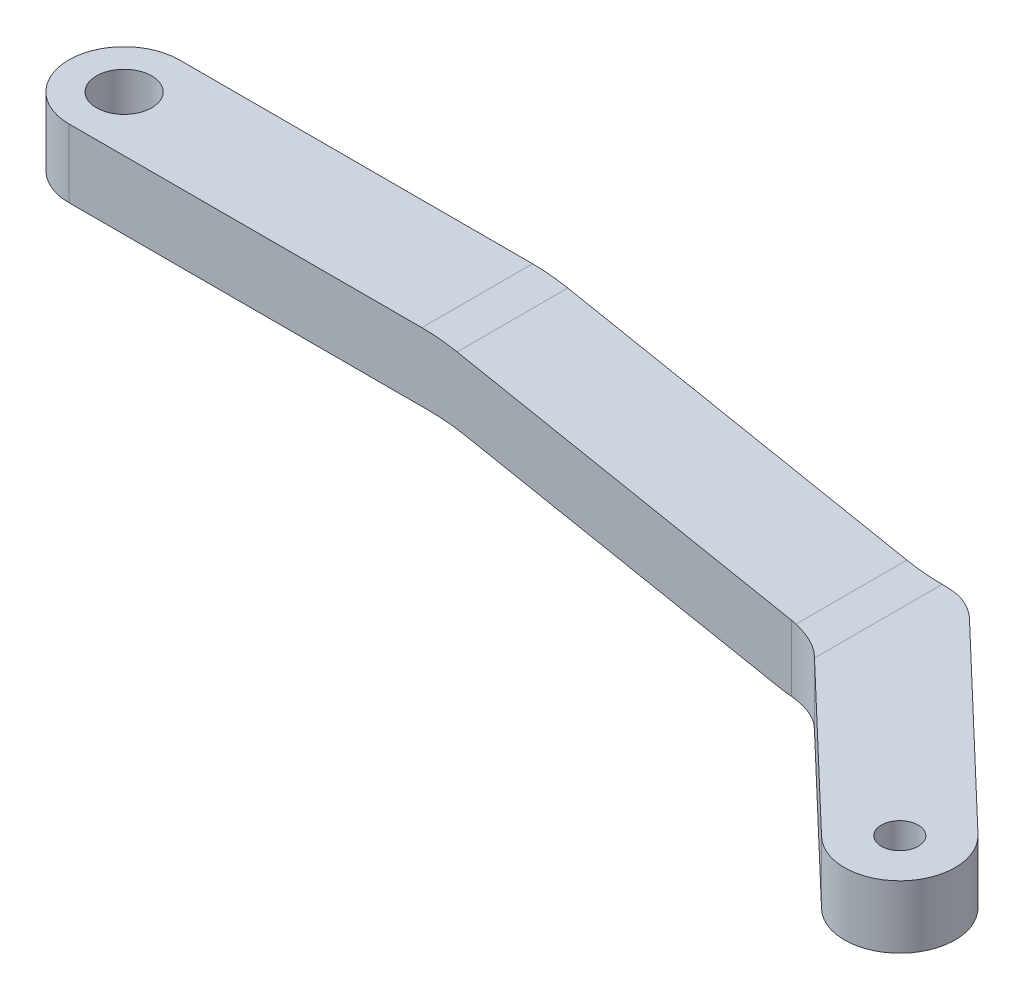
ISO-10303-21;
HEADER;
FILE_DESCRIPTION(('STEP AP214'),'2;1');
FILE_NAME('part.step','',(''),(''),'','','');
FILE_SCHEMA(('AUTOMOTIVE_DESIGN { 1 0 10303 214 1 1 1 1 }'));
ENDSEC;
DATA;
#1=APPLICATION_CONTEXT('core data for automotive mechanical design processes');
#2=APPLICATION_PROTOCOL_DEFINITION('international standard','automotive_design',2000,#1);
#3=PRODUCT_CONTEXT('',#1,'mechanical');
#4=PRODUCT('Part','Part','',(#3));
#5=PRODUCT_RELATED_PRODUCT_CATEGORY('part','',(#4));
#6=PRODUCT_DEFINITION_FORMATION('','',#4);
#7=PRODUCT_DEFINITION_CONTEXT('part definition',#1,'design');
#8=PRODUCT_DEFINITION('design','',#6,#7);
#9=PRODUCT_DEFINITION_SHAPE('','',#8);
#10=(LENGTH_UNIT() NAMED_UNIT(*) SI_UNIT(.MILLI.,.METRE.));
#11=(NAMED_UNIT(*) PLANE_ANGLE_UNIT() SI_UNIT($,.RADIAN.));
#12=(NAMED_UNIT(*) SI_UNIT($,.STERADIAN.) SOLID_ANGLE_UNIT());
#13=UNCERTAINTY_MEASURE_WITH_UNIT(LENGTH_MEASURE(1.E-05),#10,'distance_accuracy_value','');
#14=(GEOMETRIC_REPRESENTATION_CONTEXT(3) GLOBAL_UNCERTAINTY_ASSIGNED_CONTEXT((#13)) GLOBAL_UNIT_ASSIGNED_CONTEXT((#10,
#11,#12)) REPRESENTATION_CONTEXT('',''));
#15=CARTESIAN_POINT('',(0.,0.,0.));
#16=DIRECTION('',(0.,0.,1.));
#17=DIRECTION('',(1.,0.,0.));
#18=AXIS2_PLACEMENT_3D('',#15,#16,#17);
#19=CARTESIAN_POINT('',(-14.7120367770915,3.95,3.));
#20=DIRECTION('',(0.,-1.,0.));
#21=DIRECTION('',(0.,0.,-1.));
#22=AXIS2_PLACEMENT_3D('',#19,#20,#21);
#23=PLANE('',#22);
#24=CARTESIAN_POINT('',(-11.7120367770915,3.95,0.));
#25=DIRECTION('',(0.,1.,0.));
#26=DIRECTION('',(0.,0.,1.));
#27=AXIS2_PLACEMENT_3D('',#24,#25,#26);
#28=CIRCLE('',#27,1.5);
#29=CARTESIAN_POINT('',(-11.7120367770915,3.95,1.5));
#30=VERTEX_POINT('',#29);
#31=EDGE_CURVE('E204',#30,#30,#28,.T.);
#32=ORIENTED_EDGE('',*,*,#31,.F.);
#33=EDGE_LOOP('',(#32));
#34=FACE_BOUND('',#33,.T.);
#35=DIRECTION('',(-1.,0.,0.));
#36=VECTOR('',#35,1.);
#37=CARTESIAN_POINT('',(-14.7120367770915,3.95,3.));
#38=LINE('',#37,#36);
#39=CARTESIAN_POINT('',(7.43316248288966,3.95,3.));
#40=VERTEX_POINT('',#39);
#41=CARTESIAN_POINT('',(-11.7120367770915,3.94999999999999,3.));
#42=VERTEX_POINT('',#41);
#43=EDGE_CURVE('E178',#40,#42,#38,.T.);
#44=ORIENTED_EDGE('',*,*,#43,.F.);
#45=DIRECTION('',(0.,0.,-1.));
#46=VECTOR('',#45,1.);
#47=CARTESIAN_POINT('',(7.43316248288966,3.95,3.));
#48=LINE('',#47,#46);
#49=CARTESIAN_POINT('',(7.43316248288966,3.95,-3.));
#50=VERTEX_POINT('',#49);
#51=EDGE_CURVE('E227',#40,#50,#48,.T.);
#52=ORIENTED_EDGE('',*,*,#51,.T.);
#53=DIRECTION('',(-1.,0.,0.));
#54=VECTOR('',#53,1.);
#55=CARTESIAN_POINT('',(-14.7120367770915,3.95,-3.));
#56=LINE('',#55,#54);
#57=CARTESIAN_POINT('',(-11.7120367770915,3.94999999999999,-3.));
#58=VERTEX_POINT('',#57);
#59=EDGE_CURVE('E186',#50,#58,#56,.T.);
#60=ORIENTED_EDGE('',*,*,#59,.T.);
#61=CARTESIAN_POINT('',(-11.7120367770915,3.94999999999999,0.));
#62=DIRECTION('',(0.,1.,0.));
#63=DIRECTION('',(0.,0.,1.));
#64=AXIS2_PLACEMENT_3D('',#61,#62,#63);
#65=CIRCLE('',#64,3.);
#66=EDGE_CURVE('E196',#58,#42,#65,.T.);
#67=ORIENTED_EDGE('',*,*,#66,.T.);
#68=EDGE_LOOP('',(#44,#52,#60,#67));
#69=FACE_BOUND('',#68,.T.);
#70=ADVANCED_FACE('F37',(#34,#69),#23,.F.);
#71=CARTESIAN_POINT('',(0.,0.,3.));
#72=DIRECTION('',(0.,0.,-1.));
#73=DIRECTION('',(-1.,0.,0.));
#74=AXIS2_PLACEMENT_3D('',#71,#72,#73);
#75=PLANE('',#74);
#76=CARTESIAN_POINT('',(28.5301331179421,6.6,3.));
#77=DIRECTION('',(0.,0.,-1.));
#78=DIRECTION('',(-1.,0.,0.));
#79=AXIS2_PLACEMENT_3D('',#76,#77,#78);
#80=CIRCLE('',#79,10.);
#81=CARTESIAN_POINT('',(26.6183274982807,-3.21554885233785,3.));
#82=VERTEX_POINT('',#81);
#83=CARTESIAN_POINT('',(27.475314839453,-3.34421230663169,3.));
#84=VERTEX_POINT('',#83);
#85=EDGE_CURVE('E213',#82,#84,#80,.F.);
#86=ORIENTED_EDGE('',*,*,#85,.T.);
#87=DIRECTION('',(0.,1.,0.));
#88=VECTOR('',#87,1.);
#89=CARTESIAN_POINT('',(27.475314839453,0.0466508384333688,3.));
#90=LINE('',#89,#88);
#91=CARTESIAN_POINT('',(27.475314839453,0.234243644706561,3.));
#92=VERTEX_POINT('',#91);
#93=EDGE_CURVE('E248',#84,#92,#90,.T.);
#94=ORIENTED_EDGE('',*,*,#93,.T.);
#95=DIRECTION('',(-0.981554885233785,0.191180561966146,0.));
#96=VECTOR('',#95,1.);
#97=CARTESIAN_POINT('',(8.39796322290848,3.95,3.));
#98=LINE('',#97,#96);
#99=CARTESIAN_POINT('',(9.34496810255113,3.76554885233784,3.));
#100=VERTEX_POINT('',#99);
#101=EDGE_CURVE('E192',#92,#100,#98,.T.);
#102=ORIENTED_EDGE('',*,*,#101,.T.);
#103=CARTESIAN_POINT('',(7.43316248288966,-6.05000000000001,3.));
#104=DIRECTION('',(0.,0.,-1.));
#105=DIRECTION('',(-1.,0.,0.));
#106=AXIS2_PLACEMENT_3D('',#103,#104,#105);
#107=CIRCLE('',#106,10.);
#108=EDGE_CURVE('E211',#100,#40,#107,.F.);
#109=ORIENTED_EDGE('',*,*,#108,.T.);
#110=ORIENTED_EDGE('',*,*,#43,.T.);
#111=DIRECTION('',(0.,1.,0.));
#112=VECTOR('',#111,1.);
#113=CARTESIAN_POINT('',(-11.7120367770915,-3.4,3.));
#114=LINE('',#113,#112);
#115=CARTESIAN_POINT('',(-11.7120367770915,0.249999999999995,3.));
#116=VERTEX_POINT('',#115);
#117=EDGE_CURVE('E173',#116,#42,#114,.T.);
#118=ORIENTED_EDGE('',*,*,#117,.F.);
#119=DIRECTION('',(-1.,0.,0.));
#120=VECTOR('',#119,1.);
#121=CARTESIAN_POINT('',(-14.7120367770915,0.249999999999995,3.));
#122=LINE('',#121,#120);
#123=CARTESIAN_POINT('',(7.86078480246146,0.249999999999995,3.));
#124=VERTEX_POINT('',#123);
#125=EDGE_CURVE('E156',#124,#116,#122,.T.);
#126=ORIENTED_EDGE('',*,*,#125,.F.);
#127=CARTESIAN_POINT('',(7.86078480246146,-9.75000000000001,3.));
#128=DIRECTION('',(0.,0.,-1.));
#129=DIRECTION('',(-1.,0.,0.));
#130=AXIS2_PLACEMENT_3D('',#127,#128,#129);
#131=CIRCLE('',#130,10.);
#132=CARTESIAN_POINT('',(9.77259042212292,0.0655488523378425,3.));
#133=VERTEX_POINT('',#132);
#134=EDGE_CURVE('E230',#124,#133,#131,.T.);
#135=ORIENTED_EDGE('',*,*,#134,.T.);
#136=DIRECTION('',(-0.981554885233785,0.191180561966146,0.));
#137=VECTOR('',#136,1.);
#138=CARTESIAN_POINT('',(8.82558554248027,0.249999999999995,3.));
#139=LINE('',#138,#137);
#140=EDGE_CURVE('E167',#82,#133,#139,.T.);
#141=ORIENTED_EDGE('',*,*,#140,.F.);
#142=EDGE_LOOP('',(#86,#94,#102,#109,#110,#118,#126,#135,#141));
#143=FACE_BOUND('',#142,.T.);
#144=ADVANCED_FACE('F181',(#143),#75,.F.);
#145=CARTESIAN_POINT('',(0.,0.,-3.));
#146=DIRECTION('',(0.,0.,-1.));
#147=DIRECTION('',(-1.,0.,0.));
#148=AXIS2_PLACEMENT_3D('',#145,#146,#147);
#149=PLANE('',#148);
#150=DIRECTION('',(1.,0.,0.));
#151=VECTOR('',#150,1.);
#152=CARTESIAN_POINT('',(-11.7120367770915,0.,-3.));
#153=LINE('',#152,#151);
#154=CARTESIAN_POINT('',(29.6427639629273,0.,-3.));
#155=VERTEX_POINT('',#154);
#156=CARTESIAN_POINT('',(29.8806116063639,0.,-3.));
#157=VERTEX_POINT('',#156);
#158=EDGE_CURVE('E339',#155,#157,#153,.T.);
#159=ORIENTED_EDGE('',*,*,#158,.T.);
#160=DIRECTION('',(0.,1.,0.));
#161=VECTOR('',#160,1.);
#162=CARTESIAN_POINT('',(29.8806116063639,-3.4,-3.));
#163=LINE('',#162,#161);
#164=CARTESIAN_POINT('',(29.8806116063639,-3.4,-3.));
#165=VERTEX_POINT('',#164);
#166=EDGE_CURVE('E244',#157,#165,#163,.F.);
#167=ORIENTED_EDGE('',*,*,#166,.T.);
#168=DIRECTION('',(1.,0.,0.));
#169=VECTOR('',#168,1.);
#170=CARTESIAN_POINT('',(-11.7120367770915,-3.4,-3.));
#171=LINE('',#170,#169);
#172=CARTESIAN_POINT('',(28.5301331179421,-3.4,-3.));
#173=VERTEX_POINT('',#172);
#174=EDGE_CURVE('E314',#173,#165,#171,.T.);
#175=ORIENTED_EDGE('',*,*,#174,.F.);
#176=CARTESIAN_POINT('',(28.5301331179421,6.6,-3.));
#177=DIRECTION('',(0.,0.,-1.));
#178=DIRECTION('',(-1.,0.,0.));
#179=AXIS2_PLACEMENT_3D('',#176,#177,#178);
#180=CIRCLE('',#179,10.);
#181=CARTESIAN_POINT('',(26.6183274982807,-3.21554885233785,-3.));
#182=VERTEX_POINT('',#181);
#183=EDGE_CURVE('E218',#173,#182,#180,.T.);
#184=ORIENTED_EDGE('',*,*,#183,.T.);
#185=DIRECTION('',(-0.981554885233785,0.191180561966146,0.));
#186=VECTOR('',#185,1.);
#187=CARTESIAN_POINT('',(8.82558554248027,0.249999999999995,-3.));
#188=LINE('',#187,#186);
#189=CARTESIAN_POINT('',(9.77259042212292,0.0655488523378425,-3.));
#190=VERTEX_POINT('',#189);
#191=EDGE_CURVE('E166',#182,#190,#188,.T.);
#192=ORIENTED_EDGE('',*,*,#191,.T.);
#193=CARTESIAN_POINT('',(7.86078480246146,-9.75000000000001,-3.));
#194=DIRECTION('',(0.,0.,-1.));
#195=DIRECTION('',(-1.,0.,0.));
#196=AXIS2_PLACEMENT_3D('',#193,#194,#195);
#197=CIRCLE('',#196,10.);
#198=CARTESIAN_POINT('',(7.86078480246146,0.249999999999995,-3.));
#199=VERTEX_POINT('',#198);
#200=EDGE_CURVE('E232',#190,#199,#197,.F.);
#201=ORIENTED_EDGE('',*,*,#200,.T.);
#202=DIRECTION('',(-1.,0.,0.));
#203=VECTOR('',#202,1.);
#204=CARTESIAN_POINT('',(-14.7120367770915,0.249999999999995,-3.));
#205=LINE('',#204,#203);
#206=CARTESIAN_POINT('',(-11.7120367770915,0.249999999999995,-3.));
#207=VERTEX_POINT('',#206);
#208=EDGE_CURVE('E198',#199,#207,#205,.T.);
#209=ORIENTED_EDGE('',*,*,#208,.T.);
#210=DIRECTION('',(0.,1.,0.));
#211=VECTOR('',#210,1.);
#212=CARTESIAN_POINT('',(-11.7120367770915,-3.4,-3.));
#213=LINE('',#212,#211);
#214=EDGE_CURVE('E176',#207,#58,#213,.T.);
#215=ORIENTED_EDGE('',*,*,#214,.T.);
#216=ORIENTED_EDGE('',*,*,#59,.F.);
#217=CARTESIAN_POINT('',(7.43316248288966,-6.05000000000001,-3.));
#218=DIRECTION('',(0.,0.,-1.));
#219=DIRECTION('',(-1.,0.,0.));
#220=AXIS2_PLACEMENT_3D('',#217,#218,#219);
#221=CIRCLE('',#220,10.);
#222=CARTESIAN_POINT('',(9.34496810255113,3.76554885233784,-3.));
#223=VERTEX_POINT('',#222);
#224=EDGE_CURVE('E216',#50,#223,#221,.T.);
#225=ORIENTED_EDGE('',*,*,#224,.T.);
#226=DIRECTION('',(-0.981554885233785,0.191180561966146,0.));
#227=VECTOR('',#226,1.);
#228=CARTESIAN_POINT('',(8.39796322290848,3.95,-3.));
#229=LINE('',#228,#227);
#230=CARTESIAN_POINT('',(27.7309583432658,0.184451147662151,-3.));
#231=VERTEX_POINT('',#230);
#232=EDGE_CURVE('E183',#231,#223,#229,.T.);
#233=ORIENTED_EDGE('',*,*,#232,.F.);
#234=CARTESIAN_POINT('',(29.6427639629273,10.,-3.));
#235=DIRECTION('',(0.,0.,-1.));
#236=DIRECTION('',(-1.,0.,0.));
#237=AXIS2_PLACEMENT_3D('',#234,#235,#236);
#238=CIRCLE('',#237,10.);
#239=EDGE_CURVE('E234',#231,#155,#238,.F.);
#240=ORIENTED_EDGE('',*,*,#239,.T.);
#241=EDGE_LOOP('',(#159,#167,#175,#184,#192,#201,#209,#215,#216,#225,#233,#240));
#242=FACE_BOUND('',#241,.T.);
#243=ADVANCED_FACE('F284',(#242),#149,.T.);
#244=CARTESIAN_POINT('',(8.39796322290848,3.95,3.));
#245=DIRECTION('',(-0.191180561966146,-0.981554885233785,0.));
#246=DIRECTION('',(0.981554885233785,-0.191180561966146,0.));
#247=AXIS2_PLACEMENT_3D('',#244,#245,#246);
#248=PLANE('',#247);
#249=ORIENTED_EDGE('',*,*,#101,.F.);
#250=CARTESIAN_POINT('',(27.475314839453,0.234243644706562,6.));
#251=DIRECTION('',(-0.191180561966146,-0.981554885233785,0.));
#252=DIRECTION('',(0.981554885233785,-0.191180561966146,0.));
#253=AXIS2_PLACEMENT_3D('',#250,#251,#252);
#254=ELLIPSE('',#253,3.05637519116974,3.);
#255=CARTESIAN_POINT('',(27.7309583432658,0.184451147662154,3.0109121125403));
#256=VERTEX_POINT('',#255);
#257=EDGE_CURVE('E253',#92,#256,#254,.T.);
#258=ORIENTED_EDGE('',*,*,#257,.T.);
#259=DIRECTION('',(0.,0.,-1.));
#260=VECTOR('',#259,1.);
#261=CARTESIAN_POINT('',(27.7309583432658,0.184451147662154,-3.));
#262=LINE('',#261,#260);
#263=EDGE_CURVE('E65',#256,#231,#262,.T.);
#264=ORIENTED_EDGE('',*,*,#263,.T.);
#265=ORIENTED_EDGE('',*,*,#232,.T.);
#266=DIRECTION('',(0.,0.,-1.));
#267=VECTOR('',#266,1.);
#268=CARTESIAN_POINT('',(9.34496810255113,3.76554885233784,3.));
#269=LINE('',#268,#267);
#270=EDGE_CURVE('E221',#223,#100,#269,.F.);
#271=ORIENTED_EDGE('',*,*,#270,.T.);
#272=EDGE_LOOP('',(#249,#258,#264,#265,#271));
#273=FACE_BOUND('',#272,.T.);
#274=ADVANCED_FACE('F290',(#273),#248,.F.);
#275=CARTESIAN_POINT('',(28.6779632229085,-3.4,3.));
#276=DIRECTION('',(0.690756218983956,0.,-0.723087716625714));
#277=DIRECTION('',(-0.723087716625714,0.,-0.690756218983956));
#278=AXIS2_PLACEMENT_3D('',#275,#276,#277);
#279=PLANE('',#278);
#280=CARTESIAN_POINT('',(29.6427639629273,10.,3.92166150236692));
#281=DIRECTION('',(0.690756218983956,0.,-0.723087716625714));
#282=DIRECTION('',(0.723087716625714,0.,0.690756218983956));
#283=AXIS2_PLACEMENT_3D('',#280,#281,#282);
#284=ELLIPSE('',#283,13.8295807964557,10.);
#285=CARTESIAN_POINT('',(29.6427639629273,0.,3.92166150236692));
#286=VERTEX_POINT('',#285);
#287=CARTESIAN_POINT('',(29.5475834964049,0.000452976319747014,3.83073685012286));
#288=VERTEX_POINT('',#287);
#289=EDGE_CURVE('E236',#286,#288,#284,.T.);
#290=ORIENTED_EDGE('',*,*,#289,.T.);
#291=DIRECTION('',(0.,1.,0.));
#292=VECTOR('',#291,1.);
#293=CARTESIAN_POINT('',(29.5475834964049,-3.4,3.83073685012286));
#294=LINE('',#293,#292);
#295=CARTESIAN_POINT('',(29.5475834964049,-3.4,3.83073685012286));
#296=VERTEX_POINT('',#295);
#297=EDGE_CURVE('E251',#288,#296,#294,.F.);
#298=ORIENTED_EDGE('',*,*,#297,.T.);
#299=DIRECTION('',(-0.723087716625714,0.,-0.690756218983956));
#300=VECTOR('',#299,1.);
#301=CARTESIAN_POINT('',(28.6779632229085,-3.4,3.));
#302=LINE('',#301,#300);
#303=CARTESIAN_POINT('',(38.2227210823679,-3.4,12.1179820905882));
#304=VERTEX_POINT('',#303);
#305=EDGE_CURVE('E327',#304,#296,#302,.T.);
#306=ORIENTED_EDGE('',*,*,#305,.F.);
#307=DIRECTION('',(0.,1.,0.));
#308=VECTOR('',#307,1.);
#309=CARTESIAN_POINT('',(38.2227210823679,-3.4,12.1179820905882));
#310=LINE('',#309,#308);
#311=CARTESIAN_POINT('',(38.2227210823679,0.,12.1179820905882));
#312=VERTEX_POINT('',#311);
#313=EDGE_CURVE('E336',#304,#312,#310,.T.);
#314=ORIENTED_EDGE('',*,*,#313,.T.);
#315=DIRECTION('',(-0.723087716625714,0.,-0.690756218983956));
#316=VECTOR('',#315,1.);
#317=CARTESIAN_POINT('',(28.6779632229085,0.,3.));
#318=LINE('',#317,#316);
#319=EDGE_CURVE('E197',#312,#286,#318,.T.);
#320=ORIENTED_EDGE('',*,*,#319,.T.);
#321=EDGE_LOOP('',(#290,#298,#306,#314,#320));
#322=FACE_BOUND('',#321,.T.);
#323=ADVANCED_FACE('F292',(#322),#279,.F.);
#324=CARTESIAN_POINT('',(-11.7120367770915,-3.4,0.));
#325=DIRECTION('',(0.,1.,0.));
#326=DIRECTION('',(-1.,0.,0.));
#327=AXIS2_PLACEMENT_3D('',#324,#325,#326);
#328=CYLINDRICAL_SURFACE('',#327,3.);
#329=ORIENTED_EDGE('',*,*,#214,.F.);
#330=CARTESIAN_POINT('',(-11.7120367770915,0.249999999999995,0.));
#331=DIRECTION('',(0.,1.,0.));
#332=DIRECTION('',(0.,0.,1.));
#333=AXIS2_PLACEMENT_3D('',#330,#331,#332);
#334=CIRCLE('',#333,3.);
#335=EDGE_CURVE('E160',#207,#116,#334,.T.);
#336=ORIENTED_EDGE('',*,*,#335,.T.);
#337=ORIENTED_EDGE('',*,*,#117,.T.);
#338=ORIENTED_EDGE('',*,*,#66,.F.);
#339=EDGE_LOOP('',(#329,#336,#337,#338));
#340=FACE_BOUND('',#339,.T.);
#341=ADVANCED_FACE('F171',(#340),#328,.T.);
#342=CARTESIAN_POINT('',(42.3672583962716,-3.4,7.77945579083393));
#343=DIRECTION('',(-0.690756218983955,0.,0.723087716625715));
#344=DIRECTION('',(0.723087716625715,0.,0.690756218983955));
#345=AXIS2_PLACEMENT_3D('',#342,#343,#344);
#346=PLANE('',#345);
#347=DIRECTION('',(0.723087716625715,0.,0.690756218983955));
#348=VECTOR('',#347,1.);
#349=CARTESIAN_POINT('',(42.3672583962716,-3.4,7.77945579083393));
#350=LINE('',#349,#348);
#351=CARTESIAN_POINT('',(31.9528802633158,-3.4,-2.16926314987714));
#352=VERTEX_POINT('',#351);
#353=CARTESIAN_POINT('',(42.3672583962716,-3.4,7.77945579083393));
#354=VERTEX_POINT('',#353);
#355=EDGE_CURVE('E332',#352,#354,#350,.T.);
#356=ORIENTED_EDGE('',*,*,#355,.F.);
#357=DIRECTION('',(0.,1.,0.));
#358=VECTOR('',#357,1.);
#359=CARTESIAN_POINT('',(31.9528802633158,0.,-2.16926314987715));
#360=LINE('',#359,#358);
#361=CARTESIAN_POINT('',(31.9528802633158,0.,-2.16926314987714));
#362=VERTEX_POINT('',#361);
#363=EDGE_CURVE('E239',#352,#362,#360,.T.);
#364=ORIENTED_EDGE('',*,*,#363,.T.);
#365=DIRECTION('',(0.723087716625715,0.,0.690756218983955));
#366=VECTOR('',#365,1.);
#367=CARTESIAN_POINT('',(42.3672583962716,0.,7.77945579083393));
#368=LINE('',#367,#366);
#369=CARTESIAN_POINT('',(42.3672583962716,0.,7.77945579083393));
#370=VERTEX_POINT('',#369);
#371=EDGE_CURVE('E341',#362,#370,#368,.T.);
#372=ORIENTED_EDGE('',*,*,#371,.T.);
#373=DIRECTION('',(0.,1.,0.));
#374=VECTOR('',#373,1.);
#375=CARTESIAN_POINT('',(42.3672583962716,-3.4,7.77945579083393));
#376=LINE('',#375,#374);
#377=EDGE_CURVE('E188',#354,#370,#376,.T.);
#378=ORIENTED_EDGE('',*,*,#377,.F.);
#379=EDGE_LOOP('',(#356,#364,#372,#378));
#380=FACE_BOUND('',#379,.T.);
#381=ADVANCED_FACE('F371',(#380),#346,.F.);
#382=CARTESIAN_POINT('',(40.2949897393198,-3.4,9.94871894071107));
#383=DIRECTION('',(0.,1.,0.));
#384=DIRECTION('',(-1.,0.,0.));
#385=AXIS2_PLACEMENT_3D('',#382,#383,#384);
#386=CYLINDRICAL_SURFACE('',#385,3.);
#387=CARTESIAN_POINT('',(40.2949897393198,0.,9.94871894071107));
#388=DIRECTION('',(0.,-1.,0.));
#389=DIRECTION('',(1.,0.,0.));
#390=AXIS2_PLACEMENT_3D('',#387,#388,#389);
#391=CIRCLE('',#390,3.);
#392=EDGE_CURVE('E330',#370,#312,#391,.T.);
#393=ORIENTED_EDGE('',*,*,#392,.T.);
#394=ORIENTED_EDGE('',*,*,#313,.F.);
#395=CARTESIAN_POINT('',(40.2949897393198,-3.4,9.94871894071107));
#396=DIRECTION('',(0.,-1.,0.));
#397=DIRECTION('',(1.,0.,0.));
#398=AXIS2_PLACEMENT_3D('',#395,#396,#397);
#399=CIRCLE('',#398,3.);
#400=EDGE_CURVE('E334',#354,#304,#399,.T.);
#401=ORIENTED_EDGE('',*,*,#400,.F.);
#402=ORIENTED_EDGE('',*,*,#377,.T.);
#403=EDGE_LOOP('',(#393,#394,#401,#402));
#404=FACE_BOUND('',#403,.T.);
#405=ADVANCED_FACE('F350',(#404),#386,.T.);
#406=CARTESIAN_POINT('',(40.2949897393198,-3.4,9.94871894071107));
#407=DIRECTION('',(0.,-1.,0.));
#408=DIRECTION('',(1.,0.,0.));
#409=AXIS2_PLACEMENT_3D('',#406,#407,#408);
#410=PLANE('',#409);
#411=CARTESIAN_POINT('',(40.2949897393198,-3.4,9.94871894071107));
#412=DIRECTION('',(0.,1.,0.));
#413=DIRECTION('',(0.,0.,1.));
#414=AXIS2_PLACEMENT_3D('',#411,#412,#413);
#415=CIRCLE('',#414,0.999999999999998);
#416=CARTESIAN_POINT('',(40.2949897393198,-3.4,10.9487189407111));
#417=VERTEX_POINT('',#416);
#418=EDGE_CURVE('E323',#417,#417,#415,.T.);
#419=ORIENTED_EDGE('',*,*,#418,.T.);
#420=EDGE_LOOP('',(#419));
#421=FACE_BOUND('',#420,.T.);
#422=ORIENTED_EDGE('',*,*,#174,.T.);
#423=CARTESIAN_POINT('',(29.8806116063639,-3.4,0.));
#424=DIRECTION('',(0.,-1.,0.));
#425=DIRECTION('',(1.,0.,0.));
#426=AXIS2_PLACEMENT_3D('',#423,#424,#425);
#427=CIRCLE('',#426,3.);
#428=EDGE_CURVE('E246',#165,#352,#427,.T.);
#429=ORIENTED_EDGE('',*,*,#428,.T.);
#430=ORIENTED_EDGE('',*,*,#355,.T.);
#431=ORIENTED_EDGE('',*,*,#400,.T.);
#432=ORIENTED_EDGE('',*,*,#305,.T.);
#433=CARTESIAN_POINT('',(27.475314839453,-3.4,6.));
#434=DIRECTION('',(0.,-1.,0.));
#435=DIRECTION('',(1.,0.,0.));
#436=AXIS2_PLACEMENT_3D('',#433,#434,#435);
#437=CIRCLE('',#436,3.);
#438=CARTESIAN_POINT('',(28.5301331179421,-3.4,3.1915558756909));
#439=VERTEX_POINT('',#438);
#440=EDGE_CURVE('E51',#296,#439,#437,.F.);
#441=ORIENTED_EDGE('',*,*,#440,.T.);
#442=DIRECTION('',(0.,0.,1.));
#443=VECTOR('',#442,1.);
#444=CARTESIAN_POINT('',(28.5301331179421,-3.4,-3.));
#445=LINE('',#444,#443);
#446=EDGE_CURVE('E57',#439,#173,#445,.F.);
#447=ORIENTED_EDGE('',*,*,#446,.T.);
#448=EDGE_LOOP('',(#422,#429,#430,#431,#432,#441,#447));
#449=FACE_BOUND('',#448,.T.);
#450=ADVANCED_FACE('F369',(#421,#449),#410,.T.);
#451=CARTESIAN_POINT('',(40.2949897393198,0.,9.94871894071107));
#452=DIRECTION('',(0.,-1.,0.));
#453=DIRECTION('',(1.,0.,0.));
#454=AXIS2_PLACEMENT_3D('',#451,#452,#453);
#455=PLANE('',#454);
#456=CARTESIAN_POINT('',(40.2949897393198,0.,9.94871894071107));
#457=DIRECTION('',(0.,-1.,0.));
#458=DIRECTION('',(1.,0.,0.));
#459=AXIS2_PLACEMENT_3D('',#456,#457,#458);
#460=CIRCLE('',#459,0.999999999999998);
#461=CARTESIAN_POINT('',(41.2949897393198,0.,9.94871894071107));
#462=VERTEX_POINT('',#461);
#463=EDGE_CURVE('E203',#462,#462,#460,.T.);
#464=ORIENTED_EDGE('',*,*,#463,.T.);
#465=EDGE_LOOP('',(#464));
#466=FACE_BOUND('',#465,.T.);
#467=ORIENTED_EDGE('',*,*,#371,.F.);
#468=CARTESIAN_POINT('',(29.8806116063639,0.,0.));
#469=DIRECTION('',(0.,-1.,0.));
#470=DIRECTION('',(1.,0.,0.));
#471=AXIS2_PLACEMENT_3D('',#468,#469,#470);
#472=CIRCLE('',#471,3.);
#473=EDGE_CURVE('E242',#362,#157,#472,.F.);
#474=ORIENTED_EDGE('',*,*,#473,.T.);
#475=ORIENTED_EDGE('',*,*,#158,.F.);
#476=DIRECTION('',(0.,0.,-1.));
#477=VECTOR('',#476,1.);
#478=CARTESIAN_POINT('',(29.6427639629273,0.,3.));
#479=LINE('',#478,#477);
#480=EDGE_CURVE('E225',#155,#286,#479,.F.);
#481=ORIENTED_EDGE('',*,*,#480,.T.);
#482=ORIENTED_EDGE('',*,*,#319,.F.);
#483=ORIENTED_EDGE('',*,*,#392,.F.);
#484=EDGE_LOOP('',(#467,#474,#475,#481,#482,#483));
#485=FACE_BOUND('',#484,.T.);
#486=ADVANCED_FACE('F357',(#466,#485),#455,.F.);
#487=CARTESIAN_POINT('',(-14.7120367770915,0.249999999999995,-3.));
#488=DIRECTION('',(0.,1.,0.));
#489=DIRECTION('',(0.,0.,1.));
#490=AXIS2_PLACEMENT_3D('',#487,#488,#489);
#491=PLANE('',#490);
#492=CARTESIAN_POINT('',(-11.7120367770915,0.249999999999995,0.));
#493=DIRECTION('',(0.,1.,0.));
#494=DIRECTION('',(0.,0.,1.));
#495=AXIS2_PLACEMENT_3D('',#492,#493,#494);
#496=CIRCLE('',#495,1.5);
#497=CARTESIAN_POINT('',(-11.7120367770915,0.249999999999995,1.5));
#498=VERTEX_POINT('',#497);
#499=EDGE_CURVE('E200',#498,#498,#496,.T.);
#500=ORIENTED_EDGE('',*,*,#499,.T.);
#501=EDGE_LOOP('',(#500));
#502=FACE_BOUND('',#501,.T.);
#503=ORIENTED_EDGE('',*,*,#208,.F.);
#504=DIRECTION('',(0.,0.,1.));
#505=VECTOR('',#504,1.);
#506=CARTESIAN_POINT('',(7.86078480246146,0.249999999999995,3.));
#507=LINE('',#506,#505);
#508=EDGE_CURVE('E163',#199,#124,#507,.T.);
#509=ORIENTED_EDGE('',*,*,#508,.T.);
#510=ORIENTED_EDGE('',*,*,#125,.T.);
#511=ORIENTED_EDGE('',*,*,#335,.F.);
#512=EDGE_LOOP('',(#503,#509,#510,#511));
#513=FACE_BOUND('',#512,.T.);
#514=ADVANCED_FACE('F159',(#502,#513),#491,.F.);
#515=CARTESIAN_POINT('',(8.82558554248027,0.249999999999995,-3.));
#516=DIRECTION('',(0.191180561966146,0.981554885233785,0.));
#517=DIRECTION('',(-0.981554885233785,0.191180561966146,0.));
#518=AXIS2_PLACEMENT_3D('',#515,#516,#517);
#519=PLANE('',#518);
#520=ORIENTED_EDGE('',*,*,#191,.F.);
#521=DIRECTION('',(0.,0.,1.));
#522=VECTOR('',#521,1.);
#523=CARTESIAN_POINT('',(26.6183274982807,-3.21554885233785,3.));
#524=LINE('',#523,#522);
#525=EDGE_CURVE('E208',#182,#82,#524,.T.);
#526=ORIENTED_EDGE('',*,*,#525,.T.);
#527=ORIENTED_EDGE('',*,*,#140,.T.);
#528=DIRECTION('',(0.,0.,1.));
#529=VECTOR('',#528,1.);
#530=CARTESIAN_POINT('',(9.77259042212292,0.0655488523378413,-3.));
#531=LINE('',#530,#529);
#532=EDGE_CURVE('E177',#133,#190,#531,.F.);
#533=ORIENTED_EDGE('',*,*,#532,.T.);
#534=EDGE_LOOP('',(#520,#526,#527,#533));
#535=FACE_BOUND('',#534,.T.);
#536=ADVANCED_FACE('F316',(#535),#519,.F.);
#537=CARTESIAN_POINT('',(-11.7120367770915,-3.4,0.));
#538=DIRECTION('',(0.,1.,0.));
#539=DIRECTION('',(0.,0.,1.));
#540=AXIS2_PLACEMENT_3D('',#537,#538,#539);
#541=CYLINDRICAL_SURFACE('',#540,1.5);
#542=ORIENTED_EDGE('',*,*,#31,.T.);
#543=EDGE_LOOP('',(#542));
#544=FACE_BOUND('',#543,.T.);
#545=ORIENTED_EDGE('',*,*,#499,.F.);
#546=EDGE_LOOP('',(#545));
#547=FACE_BOUND('',#546,.T.);
#548=ADVANCED_FACE('F303',(#544,#547),#541,.F.);
#549=CARTESIAN_POINT('',(40.2949897393198,-3.4,9.94871894071107));
#550=DIRECTION('',(0.,1.,0.));
#551=DIRECTION('',(0.,0.,1.));
#552=AXIS2_PLACEMENT_3D('',#549,#550,#551);
#553=CYLINDRICAL_SURFACE('',#552,0.999999999999998);
#554=ORIENTED_EDGE('',*,*,#418,.F.);
#555=EDGE_LOOP('',(#554));
#556=FACE_BOUND('',#555,.T.);
#557=ORIENTED_EDGE('',*,*,#463,.F.);
#558=EDGE_LOOP('',(#557));
#559=FACE_BOUND('',#558,.T.);
#560=ADVANCED_FACE('F297',(#556,#559),#553,.F.);
#561=CARTESIAN_POINT('',(28.5301331179421,6.6,-3.));
#562=DIRECTION('',(0.,0.,-1.));
#563=DIRECTION('',(-1.,0.,0.));
#564=AXIS2_PLACEMENT_3D('',#561,#562,#563);
#565=CYLINDRICAL_SURFACE('',#564,10.);
#566=ORIENTED_EDGE('',*,*,#183,.F.);
#567=ORIENTED_EDGE('',*,*,#446,.F.);
#568=CARTESIAN_POINT('',(28.5301331179421,-3.4,3.1915558756909));
#569=CARTESIAN_POINT('',(28.4455326226416,-3.40001183912057,3.15976500866427));
#570=CARTESIAN_POINT('',(28.3594849522397,-3.39892642713121,3.13182489342494));
#571=CARTESIAN_POINT('',(28.1860353911706,-3.39444843201104,3.08403085094711));
#572=CARTESIAN_POINT('',(28.0986517296496,-3.39107594994117,3.06410886342384));
#573=CARTESIAN_POINT('',(27.9225749298865,-3.38191573279832,3.03217856692425));
#574=CARTESIAN_POINT('',(27.8338817913,-3.37612799709021,3.02017026002898));
#575=CARTESIAN_POINT('',(27.6551894687911,-3.3620601885166,3.0040384396043));
#576=CARTESIAN_POINT('',(27.5651856481966,-3.35375874445448,2.99998485896882));
#577=CARTESIAN_POINT('',(27.475314839453,-3.34421230663169,3.));
#578=B_SPLINE_CURVE_WITH_KNOTS('',3,(#568,#569,#570,#571,#572,#573,#574,#575,#576,#577),
.UNSPECIFIED.,.F.,.F.,(4,2,2,2,4),(0.,0.271030633270413,0.539709531884204,0.808388501152846,
1.07941912719599),.UNSPECIFIED.);
#579=EDGE_CURVE('E11',#439,#84,#578,.T.);
#580=ORIENTED_EDGE('',*,*,#579,.T.);
#581=ORIENTED_EDGE('',*,*,#85,.F.);
#582=ORIENTED_EDGE('',*,*,#525,.F.);
#583=EDGE_LOOP('',(#566,#567,#580,#581,#582));
#584=FACE_BOUND('',#583,.T.);
#585=ADVANCED_FACE('F294',(#584),#565,.T.);
#586=CARTESIAN_POINT('',(7.86078480246146,-9.75000000000001,-3.));
#587=DIRECTION('',(0.,0.,-1.));
#588=DIRECTION('',(-1.,0.,0.));
#589=AXIS2_PLACEMENT_3D('',#586,#587,#588);
#590=CYLINDRICAL_SURFACE('',#589,10.);
#591=ORIENTED_EDGE('',*,*,#200,.F.);
#592=ORIENTED_EDGE('',*,*,#532,.F.);
#593=ORIENTED_EDGE('',*,*,#134,.F.);
#594=ORIENTED_EDGE('',*,*,#508,.F.);
#595=EDGE_LOOP('',(#591,#592,#593,#594));
#596=FACE_BOUND('',#595,.T.);
#597=ADVANCED_FACE('F267',(#596),#590,.F.);
#598=CARTESIAN_POINT('',(29.6427639629273,10.,3.));
#599=DIRECTION('',(0.,0.,1.));
#600=DIRECTION('',(1.,0.,0.));
#601=AXIS2_PLACEMENT_3D('',#598,#599,#600);
#602=CYLINDRICAL_SURFACE('',#601,10.);
#603=ORIENTED_EDGE('',*,*,#289,.F.);
#604=ORIENTED_EDGE('',*,*,#480,.F.);
#605=ORIENTED_EDGE('',*,*,#239,.F.);
#606=ORIENTED_EDGE('',*,*,#263,.F.);
#607=CARTESIAN_POINT('',(27.7309583432658,0.184451147662152,3.0109121125403));
#608=CARTESIAN_POINT('',(27.8123487664852,0.168588291265019,3.01786123310681));
#609=CARTESIAN_POINT('',(27.8936675699991,0.153810201191925,3.0281761031178));
#610=CARTESIAN_POINT('',(28.0555380184595,0.126429321906675,3.05550357467531));
#611=CARTESIAN_POINT('',(28.1360896976917,0.113826435041505,3.07251587543655));
#612=CARTESIAN_POINT('',(28.2935184828813,0.0911305768135071,3.1126214515546));
#613=CARTESIAN_POINT('',(28.3704347120745,0.0809759754854065,3.13552628384106));
#614=CARTESIAN_POINT('',(28.5223925779429,0.0626652528891034,3.18751428003376));
#615=CARTESIAN_POINT('',(28.5974342265061,0.054509118944438,3.21659740474833));
#616=CARTESIAN_POINT('',(28.7505907518316,0.0395592831469471,3.2831724605817));
#617=CARTESIAN_POINT('',(28.8285183496415,0.0329122666563096,3.32112929566299));
#618=CARTESIAN_POINT('',(28.9809181772377,0.0216332590975162,3.40371919873566));
#619=CARTESIAN_POINT('',(29.0553898035878,0.0170016187540215,3.44835342694181));
#620=CARTESIAN_POINT('',(29.2025445650064,0.00941441538154442,3.54547609239723));
#621=CARTESIAN_POINT('',(29.2750958373483,0.00651673862652335,3.59816891137066));
#622=CARTESIAN_POINT('',(29.4152231918755,0.00234206383709819,3.70984605464188));
#623=CARTESIAN_POINT('',(29.4827997021614,0.00106492619408524,3.7688298365018));
#624=CARTESIAN_POINT('',(29.5475834964049,0.000452976319747451,3.83073685012286));
#625=B_SPLINE_CURVE_WITH_KNOTS('',3,(#607,#608,#609,#610,#611,#612,#613,#614,#615,#616,#617,
#618,#619,#620,#621,#622,#623,#624),.UNSPECIFIED.,.F.,.F.,(4,2,2,2,2,2,2,2,4),(0.,
0.249570323358369,0.499129439654679,0.741529524951174,0.983928072641788,1.24437737355633,
1.50487198089968,1.77363753481561,2.04237993314529),.UNSPECIFIED.);
#626=EDGE_CURVE('E255',#256,#288,#625,.T.);
#627=ORIENTED_EDGE('',*,*,#626,.T.);
#628=EDGE_LOOP('',(#603,#604,#605,#606,#627));
#629=FACE_BOUND('',#628,.T.);
#630=ADVANCED_FACE('F261',(#629),#602,.F.);
#631=CARTESIAN_POINT('',(7.43316248288966,-6.05000000000001,3.));
#632=DIRECTION('',(0.,0.,-1.));
#633=DIRECTION('',(-1.,0.,0.));
#634=AXIS2_PLACEMENT_3D('',#631,#632,#633);
#635=CYLINDRICAL_SURFACE('',#634,10.);
#636=ORIENTED_EDGE('',*,*,#108,.F.);
#637=ORIENTED_EDGE('',*,*,#270,.F.);
#638=ORIENTED_EDGE('',*,*,#224,.F.);
#639=ORIENTED_EDGE('',*,*,#51,.F.);
#640=EDGE_LOOP('',(#636,#637,#638,#639));
#641=FACE_BOUND('',#640,.T.);
#642=ADVANCED_FACE('F266',(#641),#635,.T.);
#643=CARTESIAN_POINT('',(29.8806116063639,-3.4,0.));
#644=DIRECTION('',(0.,-1.,0.));
#645=DIRECTION('',(1.,0.,0.));
#646=AXIS2_PLACEMENT_3D('',#643,#644,#645);
#647=CYLINDRICAL_SURFACE('',#646,3.);
#648=ORIENTED_EDGE('',*,*,#428,.F.);
#649=ORIENTED_EDGE('',*,*,#166,.F.);
#650=ORIENTED_EDGE('',*,*,#473,.F.);
#651=ORIENTED_EDGE('',*,*,#363,.F.);
#652=EDGE_LOOP('',(#648,#649,#650,#651));
#653=FACE_BOUND('',#652,.T.);
#654=ADVANCED_FACE('F269',(#653),#647,.T.);
#655=CARTESIAN_POINT('',(27.475314839453,0.,6.));
#656=DIRECTION('',(0.,-1.,0.));
#657=DIRECTION('',(1.,0.,0.));
#658=AXIS2_PLACEMENT_3D('',#655,#656,#657);
#659=CYLINDRICAL_SURFACE('',#658,3.);
#660=ORIENTED_EDGE('',*,*,#440,.F.);
#661=ORIENTED_EDGE('',*,*,#297,.F.);
#662=ORIENTED_EDGE('',*,*,#626,.F.);
#663=ORIENTED_EDGE('',*,*,#257,.F.);
#664=ORIENTED_EDGE('',*,*,#93,.F.);
#665=ORIENTED_EDGE('',*,*,#579,.F.);
#666=EDGE_LOOP('',(#660,#661,#662,#663,#664,#665));
#667=FACE_BOUND('',#666,.T.);
#668=ADVANCED_FACE('F39',(#667),#659,.F.);
#669=CLOSED_SHELL('',(#70,#144,#243,#274,#323,#341,#381,#405,#450,#486,#514,#536,#548,#560,#585,
#597,#630,#642,#654,#668));
#670=MANIFOLD_SOLID_BREP('B2',#669);
#671=ADVANCED_BREP_SHAPE_REPRESENTATION('',(#18,#670),#14);
#672=SHAPE_DEFINITION_REPRESENTATION(#9,#671);
ENDSEC;
END-ISO-10303-21;
